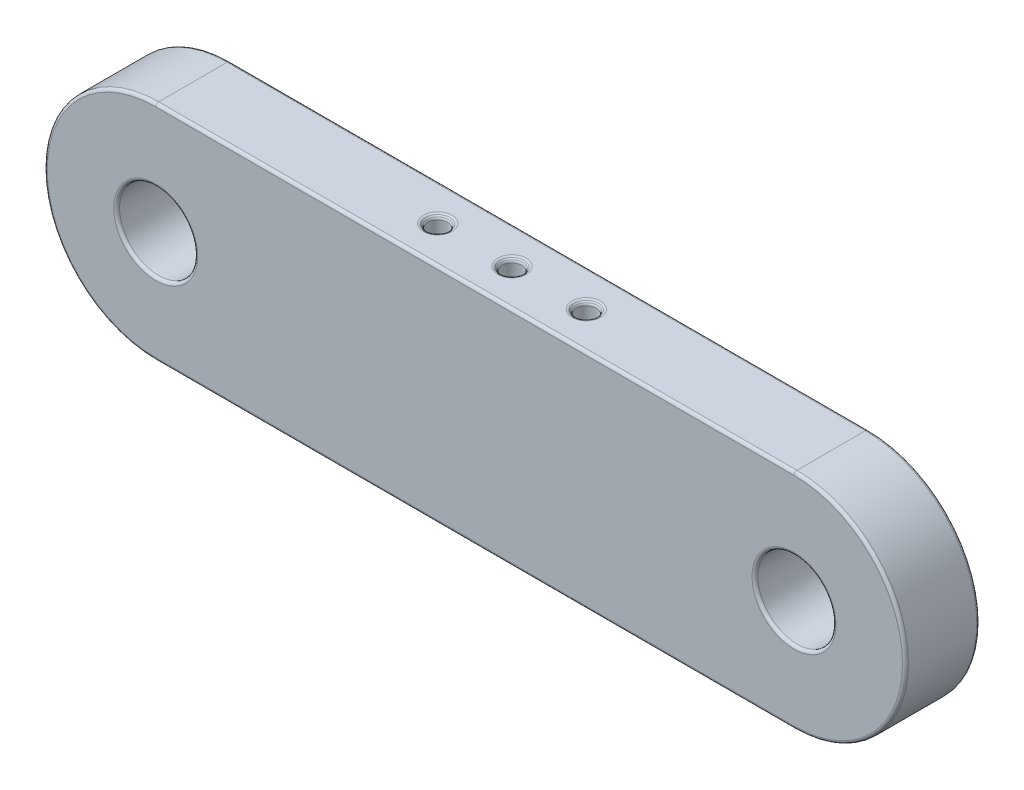
ISO-10303-21;
HEADER;
FILE_DESCRIPTION(('STEP AP214'),'2;1');
FILE_NAME('part.step','',(''),(''),'','','');
FILE_SCHEMA(('AUTOMOTIVE_DESIGN { 1 0 10303 214 1 1 1 1 }'));
ENDSEC;
DATA;
#1=APPLICATION_CONTEXT('core data for automotive mechanical design processes');
#2=APPLICATION_PROTOCOL_DEFINITION('international standard','automotive_design',2000,#1);
#3=PRODUCT_CONTEXT('',#1,'mechanical');
#4=PRODUCT('Part','Part','',(#3));
#5=PRODUCT_RELATED_PRODUCT_CATEGORY('part','',(#4));
#6=PRODUCT_DEFINITION_FORMATION('','',#4);
#7=PRODUCT_DEFINITION_CONTEXT('part definition',#1,'design');
#8=PRODUCT_DEFINITION('design','',#6,#7);
#9=PRODUCT_DEFINITION_SHAPE('','',#8);
#10=(LENGTH_UNIT() NAMED_UNIT(*) SI_UNIT(.MILLI.,.METRE.));
#11=(NAMED_UNIT(*) PLANE_ANGLE_UNIT() SI_UNIT($,.RADIAN.));
#12=(NAMED_UNIT(*) SI_UNIT($,.STERADIAN.) SOLID_ANGLE_UNIT());
#13=UNCERTAINTY_MEASURE_WITH_UNIT(LENGTH_MEASURE(1.E-05),#10,'distance_accuracy_value','');
#14=(GEOMETRIC_REPRESENTATION_CONTEXT(3) GLOBAL_UNCERTAINTY_ASSIGNED_CONTEXT((#13)) GLOBAL_UNIT_ASSIGNED_CONTEXT((#10,
#11,#12)) REPRESENTATION_CONTEXT('',''));
#15=CARTESIAN_POINT('',(0.,0.,0.));
#16=DIRECTION('',(0.,0.,1.));
#17=DIRECTION('',(1.,0.,0.));
#18=AXIS2_PLACEMENT_3D('',#15,#16,#17);
#19=CARTESIAN_POINT('',(-42.95,0.,10.));
#20=DIRECTION('',(0.,0.,1.));
#21=DIRECTION('',(1.,0.,0.));
#22=AXIS2_PLACEMENT_3D('',#19,#20,#21);
#23=PLANE('',#22);
#24=CARTESIAN_POINT('',(42.95,0.,10.));
#25=DIRECTION('',(0.,0.,1.));
#26=DIRECTION('',(1.,0.,0.));
#27=AXIS2_PLACEMENT_3D('',#24,#25,#26);
#28=CIRCLE('',#27,5.65);
#29=CARTESIAN_POINT('',(48.6,0.,10.));
#30=VERTEX_POINT('',#29);
#31=EDGE_CURVE('E254',#30,#30,#28,.F.);
#32=ORIENTED_EDGE('',*,*,#31,.T.);
#33=EDGE_LOOP('',(#32));
#34=FACE_BOUND('',#33,.T.);
#35=CARTESIAN_POINT('',(42.95,0.,10.));
#36=DIRECTION('',(0.,0.,1.));
#37=DIRECTION('',(1.,0.,0.));
#38=AXIS2_PLACEMENT_3D('',#35,#36,#37);
#39=CIRCLE('',#38,14.6);
#40=CARTESIAN_POINT('',(42.95,-14.6,10.));
#41=VERTEX_POINT('',#40);
#42=CARTESIAN_POINT('',(42.95,14.6,10.));
#43=VERTEX_POINT('',#42);
#44=EDGE_CURVE('E52',#41,#43,#39,.T.);
#45=ORIENTED_EDGE('',*,*,#44,.T.);
#46=DIRECTION('',(-1.,0.,0.));
#47=VECTOR('',#46,1.);
#48=CARTESIAN_POINT('',(-42.95,14.6,10.));
#49=LINE('',#48,#47);
#50=CARTESIAN_POINT('',(-42.95,14.6,10.));
#51=VERTEX_POINT('',#50);
#52=EDGE_CURVE('E108',#43,#51,#49,.T.);
#53=ORIENTED_EDGE('',*,*,#52,.T.);
#54=CARTESIAN_POINT('',(-42.95,0.,10.));
#55=DIRECTION('',(0.,0.,1.));
#56=DIRECTION('',(1.,0.,0.));
#57=AXIS2_PLACEMENT_3D('',#54,#55,#56);
#58=CIRCLE('',#57,14.6);
#59=CARTESIAN_POINT('',(-42.95,-14.6,10.));
#60=VERTEX_POINT('',#59);
#61=EDGE_CURVE('E249',#51,#60,#58,.T.);
#62=ORIENTED_EDGE('',*,*,#61,.T.);
#63=DIRECTION('',(1.,0.,0.));
#64=VECTOR('',#63,1.);
#65=CARTESIAN_POINT('',(42.95,-14.6,10.));
#66=LINE('',#65,#64);
#67=EDGE_CURVE('E57',#60,#41,#66,.T.);
#68=ORIENTED_EDGE('',*,*,#67,.T.);
#69=EDGE_LOOP('',(#45,#53,#62,#68));
#70=FACE_BOUND('',#69,.T.);
#71=CARTESIAN_POINT('',(-42.95,0.,10.));
#72=DIRECTION('',(0.,0.,1.));
#73=DIRECTION('',(1.,0.,0.));
#74=AXIS2_PLACEMENT_3D('',#71,#72,#73);
#75=CIRCLE('',#74,5.65);
#76=CARTESIAN_POINT('',(-37.3,0.,10.));
#77=VERTEX_POINT('',#76);
#78=EDGE_CURVE('E246',#77,#77,#75,.F.);
#79=ORIENTED_EDGE('',*,*,#78,.T.);
#80=EDGE_LOOP('',(#79));
#81=FACE_BOUND('',#80,.T.);
#82=ADVANCED_FACE('F35',(#34,#70,#81),#23,.T.);
#83=CARTESIAN_POINT('',(-42.95,0.,0.));
#84=DIRECTION('',(0.,0.,1.));
#85=DIRECTION('',(1.,0.,0.));
#86=AXIS2_PLACEMENT_3D('',#83,#84,#85);
#87=PLANE('',#86);
#88=CARTESIAN_POINT('',(42.95,0.,0.));
#89=DIRECTION('',(0.,0.,1.));
#90=DIRECTION('',(1.,0.,0.));
#91=AXIS2_PLACEMENT_3D('',#88,#89,#90);
#92=CIRCLE('',#91,5.65);
#93=CARTESIAN_POINT('',(48.6,0.,0.));
#94=VERTEX_POINT('',#93);
#95=EDGE_CURVE('E157',#94,#94,#92,.T.);
#96=ORIENTED_EDGE('',*,*,#95,.T.);
#97=EDGE_LOOP('',(#96));
#98=FACE_BOUND('',#97,.T.);
#99=CARTESIAN_POINT('',(-42.95,0.,0.));
#100=DIRECTION('',(0.,0.,1.));
#101=DIRECTION('',(1.,0.,0.));
#102=AXIS2_PLACEMENT_3D('',#99,#100,#101);
#103=CIRCLE('',#102,5.65);
#104=CARTESIAN_POINT('',(-37.3,0.,0.));
#105=VERTEX_POINT('',#104);
#106=EDGE_CURVE('E154',#105,#105,#103,.T.);
#107=ORIENTED_EDGE('',*,*,#106,.T.);
#108=EDGE_LOOP('',(#107));
#109=FACE_BOUND('',#108,.T.);
#110=DIRECTION('',(-1.,0.,0.));
#111=VECTOR('',#110,1.);
#112=CARTESIAN_POINT('',(-42.95,14.6,0.));
#113=LINE('',#112,#111);
#114=CARTESIAN_POINT('',(-42.95,14.6,0.));
#115=VERTEX_POINT('',#114);
#116=CARTESIAN_POINT('',(42.95,14.6,0.));
#117=VERTEX_POINT('',#116);
#118=EDGE_CURVE('E145',#115,#117,#113,.F.);
#119=ORIENTED_EDGE('',*,*,#118,.T.);
#120=CARTESIAN_POINT('',(42.95,0.,0.));
#121=DIRECTION('',(0.,0.,1.));
#122=DIRECTION('',(1.,0.,0.));
#123=AXIS2_PLACEMENT_3D('',#120,#121,#122);
#124=CIRCLE('',#123,14.6);
#125=CARTESIAN_POINT('',(42.95,-14.6,0.));
#126=VERTEX_POINT('',#125);
#127=EDGE_CURVE('E151',#117,#126,#124,.F.);
#128=ORIENTED_EDGE('',*,*,#127,.T.);
#129=DIRECTION('',(1.,0.,0.));
#130=VECTOR('',#129,1.);
#131=CARTESIAN_POINT('',(-42.95,-14.6,0.));
#132=LINE('',#131,#130);
#133=CARTESIAN_POINT('',(-42.95,-14.6,0.));
#134=VERTEX_POINT('',#133);
#135=EDGE_CURVE('E149',#126,#134,#132,.F.);
#136=ORIENTED_EDGE('',*,*,#135,.T.);
#137=CARTESIAN_POINT('',(-42.95,0.,0.));
#138=DIRECTION('',(0.,0.,1.));
#139=DIRECTION('',(1.,0.,0.));
#140=AXIS2_PLACEMENT_3D('',#137,#138,#139);
#141=CIRCLE('',#140,14.6);
#142=EDGE_CURVE('E147',#134,#115,#141,.F.);
#143=ORIENTED_EDGE('',*,*,#142,.T.);
#144=EDGE_LOOP('',(#119,#128,#136,#143));
#145=FACE_BOUND('',#144,.T.);
#146=ADVANCED_FACE('F296',(#98,#109,#145),#87,.F.);
#147=CARTESIAN_POINT('',(-42.95,0.,10.));
#148=DIRECTION('',(0.,0.,-1.));
#149=DIRECTION('',(-1.,0.,0.));
#150=AXIS2_PLACEMENT_3D('',#147,#148,#149);
#151=CYLINDRICAL_SURFACE('',#150,15.);
#152=DIRECTION('',(0.,0.,-1.));
#153=VECTOR('',#152,1.);
#154=CARTESIAN_POINT('',(-42.95,15.,10.));
#155=LINE('',#154,#153);
#156=CARTESIAN_POINT('',(-42.95,15.,9.6));
#157=VERTEX_POINT('',#156);
#158=CARTESIAN_POINT('',(-42.95,15.,0.399999999999999));
#159=VERTEX_POINT('',#158);
#160=EDGE_CURVE('E129',#157,#159,#155,.T.);
#161=ORIENTED_EDGE('',*,*,#160,.T.);
#162=CARTESIAN_POINT('',(-42.95,0.,0.399999999999999));
#163=DIRECTION('',(0.,0.,1.));
#164=DIRECTION('',(1.,0.,0.));
#165=AXIS2_PLACEMENT_3D('',#162,#163,#164);
#166=CIRCLE('',#165,15.);
#167=CARTESIAN_POINT('',(-42.95,-15.,0.399999999999999));
#168=VERTEX_POINT('',#167);
#169=EDGE_CURVE('E175',#159,#168,#166,.T.);
#170=ORIENTED_EDGE('',*,*,#169,.T.);
#171=DIRECTION('',(0.,0.,-1.));
#172=VECTOR('',#171,1.);
#173=CARTESIAN_POINT('',(-42.95,-15.,10.));
#174=LINE('',#173,#172);
#175=CARTESIAN_POINT('',(-42.95,-15.,9.6));
#176=VERTEX_POINT('',#175);
#177=EDGE_CURVE('E121',#176,#168,#174,.T.);
#178=ORIENTED_EDGE('',*,*,#177,.F.);
#179=CARTESIAN_POINT('',(-42.95,0.,9.6));
#180=DIRECTION('',(0.,0.,1.));
#181=DIRECTION('',(1.,0.,0.));
#182=AXIS2_PLACEMENT_3D('',#179,#180,#181);
#183=CIRCLE('',#182,15.);
#184=EDGE_CURVE('E173',#176,#157,#183,.F.);
#185=ORIENTED_EDGE('',*,*,#184,.T.);
#186=EDGE_LOOP('',(#161,#170,#178,#185));
#187=FACE_BOUND('',#186,.T.);
#188=ADVANCED_FACE('F282',(#187),#151,.T.);
#189=CARTESIAN_POINT('',(-42.95,-15.,10.));
#190=DIRECTION('',(0.,1.,0.));
#191=DIRECTION('',(0.,0.,1.));
#192=AXIS2_PLACEMENT_3D('',#189,#190,#191);
#193=PLANE('',#192);
#194=CARTESIAN_POINT('',(-10.0000000000153,-15.,4.99999999999981));
#195=DIRECTION('',(0.,1.,0.));
#196=DIRECTION('',(0.,0.,1.));
#197=AXIS2_PLACEMENT_3D('',#194,#195,#196);
#198=CIRCLE('',#197,1.91568542495053);
#199=CARTESIAN_POINT('',(-10.0000000000153,-15.,6.91568542495034));
#200=VERTEX_POINT('',#199);
#201=EDGE_CURVE('E168',#200,#200,#198,.T.);
#202=ORIENTED_EDGE('',*,*,#201,.T.);
#203=EDGE_LOOP('',(#202));
#204=FACE_BOUND('',#203,.T.);
#205=CARTESIAN_POINT('',(-1.42386102908176E-11,-15.,4.99999999999834));
#206=DIRECTION('',(0.,1.,0.));
#207=DIRECTION('',(0.,0.,1.));
#208=AXIS2_PLACEMENT_3D('',#205,#206,#207);
#209=CIRCLE('',#208,1.91568542494917);
#210=CARTESIAN_POINT('',(-1.42386102908176E-11,-15.,6.91568542494751));
#211=VERTEX_POINT('',#210);
#212=EDGE_CURVE('E165',#211,#211,#209,.T.);
#213=ORIENTED_EDGE('',*,*,#212,.T.);
#214=EDGE_LOOP('',(#213));
#215=FACE_BOUND('',#214,.T.);
#216=CARTESIAN_POINT('',(9.99999999998471,-15.,4.99999999999973));
#217=DIRECTION('',(0.,1.,0.));
#218=DIRECTION('',(0.,0.,1.));
#219=AXIS2_PLACEMENT_3D('',#216,#217,#218);
#220=CIRCLE('',#219,1.9156854249505);
#221=CARTESIAN_POINT('',(9.99999999998471,-15.,6.91568542495023));
#222=VERTEX_POINT('',#221);
#223=EDGE_CURVE('E162',#222,#222,#220,.T.);
#224=ORIENTED_EDGE('',*,*,#223,.T.);
#225=EDGE_LOOP('',(#224));
#226=FACE_BOUND('',#225,.T.);
#227=ORIENTED_EDGE('',*,*,#177,.T.);
#228=DIRECTION('',(1.,0.,0.));
#229=VECTOR('',#228,1.);
#230=CARTESIAN_POINT('',(-42.95,-15.,0.399999999999999));
#231=LINE('',#230,#229);
#232=CARTESIAN_POINT('',(42.95,-15.,0.399999999999999));
#233=VERTEX_POINT('',#232);
#234=EDGE_CURVE('E171',#168,#233,#231,.T.);
#235=ORIENTED_EDGE('',*,*,#234,.T.);
#236=DIRECTION('',(0.,0.,-1.));
#237=VECTOR('',#236,1.);
#238=CARTESIAN_POINT('',(42.95,-15.,10.));
#239=LINE('',#238,#237);
#240=CARTESIAN_POINT('',(42.95,-15.,9.6));
#241=VERTEX_POINT('',#240);
#242=EDGE_CURVE('E136',#241,#233,#239,.T.);
#243=ORIENTED_EDGE('',*,*,#242,.F.);
#244=DIRECTION('',(1.,0.,0.));
#245=VECTOR('',#244,1.);
#246=CARTESIAN_POINT('',(-42.95,-15.,9.6));
#247=LINE('',#246,#245);
#248=EDGE_CURVE('E160',#241,#176,#247,.F.);
#249=ORIENTED_EDGE('',*,*,#248,.T.);
#250=EDGE_LOOP('',(#227,#235,#243,#249));
#251=FACE_BOUND('',#250,.T.);
#252=ADVANCED_FACE('F279',(#204,#215,#226,#251),#193,.F.);
#253=CARTESIAN_POINT('',(42.95,0.,10.));
#254=DIRECTION('',(0.,0.,-1.));
#255=DIRECTION('',(-1.,0.,0.));
#256=AXIS2_PLACEMENT_3D('',#253,#254,#255);
#257=CYLINDRICAL_SURFACE('',#256,15.);
#258=ORIENTED_EDGE('',*,*,#242,.T.);
#259=CARTESIAN_POINT('',(42.95,0.,0.399999999999999));
#260=DIRECTION('',(0.,0.,1.));
#261=DIRECTION('',(1.,0.,0.));
#262=AXIS2_PLACEMENT_3D('',#259,#260,#261);
#263=CIRCLE('',#262,15.);
#264=CARTESIAN_POINT('',(42.95,15.,0.399999999999999));
#265=VERTEX_POINT('',#264);
#266=EDGE_CURVE('E120',#233,#265,#263,.T.);
#267=ORIENTED_EDGE('',*,*,#266,.T.);
#268=DIRECTION('',(0.,0.,-1.));
#269=VECTOR('',#268,1.);
#270=CARTESIAN_POINT('',(42.95,15.,10.));
#271=LINE('',#270,#269);
#272=CARTESIAN_POINT('',(42.95,15.,9.6));
#273=VERTEX_POINT('',#272);
#274=EDGE_CURVE('E127',#273,#265,#271,.T.);
#275=ORIENTED_EDGE('',*,*,#274,.F.);
#276=CARTESIAN_POINT('',(42.95,0.,9.6));
#277=DIRECTION('',(0.,0.,1.));
#278=DIRECTION('',(1.,0.,0.));
#279=AXIS2_PLACEMENT_3D('',#276,#277,#278);
#280=CIRCLE('',#279,15.);
#281=EDGE_CURVE('E114',#273,#241,#280,.F.);
#282=ORIENTED_EDGE('',*,*,#281,.T.);
#283=EDGE_LOOP('',(#258,#267,#275,#282));
#284=FACE_BOUND('',#283,.T.);
#285=ADVANCED_FACE('F134',(#284),#257,.T.);
#286=CARTESIAN_POINT('',(-42.95,15.,10.));
#287=DIRECTION('',(0.,-1.,0.));
#288=DIRECTION('',(0.,0.,-1.));
#289=AXIS2_PLACEMENT_3D('',#286,#287,#288);
#290=PLANE('',#289);
#291=CARTESIAN_POINT('',(9.99999999998471,15.,4.99999999999973));
#292=DIRECTION('',(0.,-1.,0.));
#293=DIRECTION('',(0.,0.,-1.));
#294=AXIS2_PLACEMENT_3D('',#291,#292,#293);
#295=CIRCLE('',#294,1.91568542495049);
#296=CARTESIAN_POINT('',(9.99999999998471,15.,3.08431457504924));
#297=VERTEX_POINT('',#296);
#298=EDGE_CURVE('E195',#297,#297,#295,.T.);
#299=ORIENTED_EDGE('',*,*,#298,.T.);
#300=EDGE_LOOP('',(#299));
#301=FACE_BOUND('',#300,.T.);
#302=CARTESIAN_POINT('',(-1.42386102908176E-11,15.,4.99999999999834));
#303=DIRECTION('',(0.,-1.,0.));
#304=DIRECTION('',(0.,0.,-1.));
#305=AXIS2_PLACEMENT_3D('',#302,#303,#304);
#306=CIRCLE('',#305,1.91568542494916);
#307=CARTESIAN_POINT('',(-1.42386102908176E-11,15.,3.08431457504918));
#308=VERTEX_POINT('',#307);
#309=EDGE_CURVE('E192',#308,#308,#306,.T.);
#310=ORIENTED_EDGE('',*,*,#309,.T.);
#311=EDGE_LOOP('',(#310));
#312=FACE_BOUND('',#311,.T.);
#313=CARTESIAN_POINT('',(-10.0000000000153,15.,4.99999999999981));
#314=DIRECTION('',(0.,-1.,0.));
#315=DIRECTION('',(0.,0.,-1.));
#316=AXIS2_PLACEMENT_3D('',#313,#314,#315);
#317=CIRCLE('',#316,1.91568542495053);
#318=CARTESIAN_POINT('',(-10.0000000000153,15.,3.08431457504928));
#319=VERTEX_POINT('',#318);
#320=EDGE_CURVE('E130',#319,#319,#317,.T.);
#321=ORIENTED_EDGE('',*,*,#320,.T.);
#322=EDGE_LOOP('',(#321));
#323=FACE_BOUND('',#322,.T.);
#324=ORIENTED_EDGE('',*,*,#160,.F.);
#325=DIRECTION('',(-1.,0.,0.));
#326=VECTOR('',#325,1.);
#327=CARTESIAN_POINT('',(42.95,15.,9.6));
#328=LINE('',#327,#326);
#329=EDGE_CURVE('E106',#157,#273,#328,.F.);
#330=ORIENTED_EDGE('',*,*,#329,.T.);
#331=ORIENTED_EDGE('',*,*,#274,.T.);
#332=DIRECTION('',(-1.,0.,0.));
#333=VECTOR('',#332,1.);
#334=CARTESIAN_POINT('',(-42.95,15.,0.399999999999999));
#335=LINE('',#334,#333);
#336=EDGE_CURVE('E131',#265,#159,#335,.T.);
#337=ORIENTED_EDGE('',*,*,#336,.T.);
#338=EDGE_LOOP('',(#324,#330,#331,#337));
#339=FACE_BOUND('',#338,.T.);
#340=ADVANCED_FACE('F126',(#301,#312,#323,#339),#290,.F.);
#341=CARTESIAN_POINT('',(-42.95,0.,10.));
#342=DIRECTION('',(0.,0.,-1.));
#343=DIRECTION('',(-1.,0.,0.));
#344=AXIS2_PLACEMENT_3D('',#341,#342,#343);
#345=CYLINDRICAL_SURFACE('',#344,5.25);
#346=CARTESIAN_POINT('',(-42.95,0.,9.6));
#347=DIRECTION('',(0.,0.,1.));
#348=DIRECTION('',(1.,0.,0.));
#349=AXIS2_PLACEMENT_3D('',#346,#347,#348);
#350=CIRCLE('',#349,5.25);
#351=CARTESIAN_POINT('',(-37.7,0.,9.6));
#352=VERTEX_POINT('',#351);
#353=EDGE_CURVE('E11',#352,#352,#350,.T.);
#354=ORIENTED_EDGE('',*,*,#353,.T.);
#355=EDGE_LOOP('',(#354));
#356=FACE_BOUND('',#355,.T.);
#357=CARTESIAN_POINT('',(-42.95,0.,0.399999999999999));
#358=DIRECTION('',(0.,0.,1.));
#359=DIRECTION('',(1.,0.,0.));
#360=AXIS2_PLACEMENT_3D('',#357,#358,#359);
#361=CIRCLE('',#360,5.25);
#362=CARTESIAN_POINT('',(-37.7,0.,0.399999999999999));
#363=VERTEX_POINT('',#362);
#364=EDGE_CURVE('E44',#363,#363,#361,.F.);
#365=ORIENTED_EDGE('',*,*,#364,.T.);
#366=EDGE_LOOP('',(#365));
#367=FACE_BOUND('',#366,.T.);
#368=ADVANCED_FACE('F321',(#356,#367),#345,.F.);
#369=CARTESIAN_POINT('',(42.95,0.,10.));
#370=DIRECTION('',(0.,0.,-1.));
#371=DIRECTION('',(-1.,0.,0.));
#372=AXIS2_PLACEMENT_3D('',#369,#370,#371);
#373=CYLINDRICAL_SURFACE('',#372,5.25);
#374=CARTESIAN_POINT('',(42.95,0.,9.6));
#375=DIRECTION('',(0.,0.,1.));
#376=DIRECTION('',(1.,0.,0.));
#377=AXIS2_PLACEMENT_3D('',#374,#375,#376);
#378=CIRCLE('',#377,5.25);
#379=CARTESIAN_POINT('',(48.2,0.,9.6));
#380=VERTEX_POINT('',#379);
#381=EDGE_CURVE('E243',#380,#380,#378,.T.);
#382=ORIENTED_EDGE('',*,*,#381,.T.);
#383=EDGE_LOOP('',(#382));
#384=FACE_BOUND('',#383,.T.);
#385=CARTESIAN_POINT('',(42.95,0.,0.399999999999999));
#386=DIRECTION('',(0.,0.,1.));
#387=DIRECTION('',(1.,0.,0.));
#388=AXIS2_PLACEMENT_3D('',#385,#386,#387);
#389=CIRCLE('',#388,5.25);
#390=CARTESIAN_POINT('',(48.2,0.,0.399999999999999));
#391=VERTEX_POINT('',#390);
#392=EDGE_CURVE('E240',#391,#391,#389,.F.);
#393=ORIENTED_EDGE('',*,*,#392,.T.);
#394=EDGE_LOOP('',(#393));
#395=FACE_BOUND('',#394,.T.);
#396=ADVANCED_FACE('F461',(#384,#395),#373,.F.);
#397=CARTESIAN_POINT('',(-10.0000000000153,-15.001,4.99999999999981));
#398=DIRECTION('',(0.,1.,0.));
#399=DIRECTION('',(0.,0.,1.));
#400=AXIS2_PLACEMENT_3D('',#397,#398,#399);
#401=CYLINDRICAL_SURFACE('',#400,1.35000000000129);
#402=CARTESIAN_POINT('',(-10.0000000000153,14.4343145750507,4.99999999999981));
#403=DIRECTION('',(0.,-1.,0.));
#404=DIRECTION('',(0.,0.,-1.));
#405=AXIS2_PLACEMENT_3D('',#402,#403,#404);
#406=CIRCLE('',#405,1.35000000000129);
#407=CARTESIAN_POINT('',(-10.0000000000153,14.4343145750507,3.64999999999852));
#408=VERTEX_POINT('',#407);
#409=EDGE_CURVE('E213',#408,#408,#406,.F.);
#410=ORIENTED_EDGE('',*,*,#409,.T.);
#411=EDGE_LOOP('',(#410));
#412=FACE_BOUND('',#411,.T.);
#413=CARTESIAN_POINT('',(-10.0000000000153,-14.4343145750508,4.99999999999981));
#414=DIRECTION('',(0.,1.,0.));
#415=DIRECTION('',(0.,0.,1.));
#416=AXIS2_PLACEMENT_3D('',#413,#414,#415);
#417=CIRCLE('',#416,1.35000000000129);
#418=CARTESIAN_POINT('',(-10.0000000000153,-14.4343145750508,6.3500000000011));
#419=VERTEX_POINT('',#418);
#420=EDGE_CURVE('E210',#419,#419,#417,.F.);
#421=ORIENTED_EDGE('',*,*,#420,.T.);
#422=EDGE_LOOP('',(#421));
#423=FACE_BOUND('',#422,.T.);
#424=ADVANCED_FACE('F463',(#412,#423),#401,.F.);
#425=CARTESIAN_POINT('',(-1.42386102908176E-11,-15.001,4.99999999999834));
#426=DIRECTION('',(0.,1.,0.));
#427=DIRECTION('',(0.,0.,1.));
#428=AXIS2_PLACEMENT_3D('',#425,#426,#427);
#429=CYLINDRICAL_SURFACE('',#428,1.34999999999992);
#430=CARTESIAN_POINT('',(-1.42386102908176E-11,14.4343145750508,4.99999999999834));
#431=DIRECTION('',(0.,-1.,0.));
#432=DIRECTION('',(0.,0.,-1.));
#433=AXIS2_PLACEMENT_3D('',#430,#431,#432);
#434=CIRCLE('',#433,1.34999999999992);
#435=CARTESIAN_POINT('',(-1.42386102908176E-11,14.4343145750508,3.64999999999841));
#436=VERTEX_POINT('',#435);
#437=EDGE_CURVE('E201',#436,#436,#434,.F.);
#438=ORIENTED_EDGE('',*,*,#437,.T.);
#439=EDGE_LOOP('',(#438));
#440=FACE_BOUND('',#439,.T.);
#441=CARTESIAN_POINT('',(-1.42386102908176E-11,-14.4343145750508,4.99999999999834));
#442=DIRECTION('',(0.,1.,0.));
#443=DIRECTION('',(0.,0.,1.));
#444=AXIS2_PLACEMENT_3D('',#441,#442,#443);
#445=CIRCLE('',#444,1.34999999999992);
#446=CARTESIAN_POINT('',(-1.42386102908176E-11,-14.4343145750508,6.34999999999826));
#447=VERTEX_POINT('',#446);
#448=EDGE_CURVE('E198',#447,#447,#445,.F.);
#449=ORIENTED_EDGE('',*,*,#448,.T.);
#450=EDGE_LOOP('',(#449));
#451=FACE_BOUND('',#450,.T.);
#452=ADVANCED_FACE('F469',(#440,#451),#429,.F.);
#453=CARTESIAN_POINT('',(9.99999999998471,-15.001,4.99999999999973));
#454=DIRECTION('',(0.,1.,0.));
#455=DIRECTION('',(0.,0.,1.));
#456=AXIS2_PLACEMENT_3D('',#453,#454,#455);
#457=CYLINDRICAL_SURFACE('',#456,1.35000000000126);
#458=CARTESIAN_POINT('',(9.99999999998471,14.4343145750508,4.99999999999973));
#459=DIRECTION('',(0.,-1.,0.));
#460=DIRECTION('',(0.,0.,-1.));
#461=AXIS2_PLACEMENT_3D('',#458,#459,#460);
#462=CIRCLE('',#461,1.35000000000126);
#463=CARTESIAN_POINT('',(9.99999999998471,14.4343145750508,3.64999999999847));
#464=VERTEX_POINT('',#463);
#465=EDGE_CURVE('E180',#464,#464,#462,.F.);
#466=ORIENTED_EDGE('',*,*,#465,.T.);
#467=EDGE_LOOP('',(#466));
#468=FACE_BOUND('',#467,.T.);
#469=CARTESIAN_POINT('',(9.99999999998471,-14.4343145750508,4.99999999999973));
#470=DIRECTION('',(0.,1.,0.));
#471=DIRECTION('',(0.,0.,1.));
#472=AXIS2_PLACEMENT_3D('',#469,#470,#471);
#473=CIRCLE('',#472,1.35000000000126);
#474=CARTESIAN_POINT('',(9.99999999998471,-14.4343145750508,6.35000000000099));
#475=VERTEX_POINT('',#474);
#476=EDGE_CURVE('E177',#475,#475,#473,.F.);
#477=ORIENTED_EDGE('',*,*,#476,.T.);
#478=EDGE_LOOP('',(#477));
#479=FACE_BOUND('',#478,.T.);
#480=ADVANCED_FACE('F342',(#468,#479),#457,.F.);
#481=CARTESIAN_POINT('',(-10.0000000000153,-14.6,4.99999999999981));
#482=DIRECTION('',(0.,-1.,0.));
#483=DIRECTION('',(0.,0.,-1.));
#484=AXIS2_PLACEMENT_3D('',#481,#482,#483);
#485=CONICAL_SURFACE('',#484,1.35000000000129,0.785398163397456);
#486=CARTESIAN_POINT('',(-10.0000000000153,-14.7171572875254,4.99999999999981));
#487=DIRECTION('',(0.,-1.,0.));
#488=DIRECTION('',(0.,0.,-1.));
#489=AXIS2_PLACEMENT_3D('',#486,#487,#488);
#490=CIRCLE('',#489,1.46715728752667);
#491=CARTESIAN_POINT('',(-10.0000000000153,-14.7171572875254,3.53284271247314));
#492=VERTEX_POINT('',#491);
#493=EDGE_CURVE('E225',#492,#492,#490,.F.);
#494=ORIENTED_EDGE('',*,*,#493,.T.);
#495=EDGE_LOOP('',(#494));
#496=FACE_BOUND('',#495,.T.);
#497=CARTESIAN_POINT('',(-10.0000000000153,-14.8828427124746,4.99999999999981));
#498=DIRECTION('',(0.,-1.,0.));
#499=DIRECTION('',(0.,0.,-1.));
#500=AXIS2_PLACEMENT_3D('',#497,#498,#499);
#501=CIRCLE('',#500,1.63284271247591);
#502=CARTESIAN_POINT('',(-10.0000000000153,-14.8828427124746,3.3671572875239));
#503=VERTEX_POINT('',#502);
#504=EDGE_CURVE('E222',#503,#503,#501,.T.);
#505=ORIENTED_EDGE('',*,*,#504,.T.);
#506=EDGE_LOOP('',(#505));
#507=FACE_BOUND('',#506,.T.);
#508=ADVANCED_FACE('F335',(#496,#507),#485,.F.);
#509=CARTESIAN_POINT('',(-1.42386102908176E-11,-14.6,4.99999999999834));
#510=DIRECTION('',(0.,-1.,0.));
#511=DIRECTION('',(0.,0.,-1.));
#512=AXIS2_PLACEMENT_3D('',#509,#510,#511);
#513=CONICAL_SURFACE('',#512,1.34999999999992,0.785398163397456);
#514=CARTESIAN_POINT('',(-1.42386102908176E-11,-14.7171572875254,4.99999999999834));
#515=DIRECTION('',(0.,-1.,0.));
#516=DIRECTION('',(0.,0.,-1.));
#517=AXIS2_PLACEMENT_3D('',#514,#515,#516);
#518=CIRCLE('',#517,1.46715728752531);
#519=CARTESIAN_POINT('',(-1.42386102908176E-11,-14.7171572875254,3.53284271247303));
#520=VERTEX_POINT('',#519);
#521=EDGE_CURVE('E231',#520,#520,#518,.F.);
#522=ORIENTED_EDGE('',*,*,#521,.T.);
#523=EDGE_LOOP('',(#522));
#524=FACE_BOUND('',#523,.T.);
#525=CARTESIAN_POINT('',(-1.42386102908176E-11,-14.8828427124746,4.99999999999834));
#526=DIRECTION('',(0.,-1.,0.));
#527=DIRECTION('',(0.,0.,-1.));
#528=AXIS2_PLACEMENT_3D('',#525,#526,#527);
#529=CIRCLE('',#528,1.63284271247455);
#530=CARTESIAN_POINT('',(-1.42386102908176E-11,-14.8828427124746,3.36715728752379));
#531=VERTEX_POINT('',#530);
#532=EDGE_CURVE('E228',#531,#531,#529,.T.);
#533=ORIENTED_EDGE('',*,*,#532,.T.);
#534=EDGE_LOOP('',(#533));
#535=FACE_BOUND('',#534,.T.);
#536=ADVANCED_FACE('F341',(#524,#535),#513,.F.);
#537=CARTESIAN_POINT('',(9.99999999998471,-14.6,4.99999999999973));
#538=DIRECTION('',(0.,-1.,0.));
#539=DIRECTION('',(0.,0.,-1.));
#540=AXIS2_PLACEMENT_3D('',#537,#538,#539);
#541=CONICAL_SURFACE('',#540,1.35000000000126,0.785398163397458);
#542=CARTESIAN_POINT('',(9.99999999998471,-14.7171572875254,4.99999999999973));
#543=DIRECTION('',(0.,-1.,0.));
#544=DIRECTION('',(0.,0.,-1.));
#545=AXIS2_PLACEMENT_3D('',#542,#543,#544);
#546=CIRCLE('',#545,1.46715728752664);
#547=CARTESIAN_POINT('',(9.99999999998471,-14.7171572875254,3.53284271247308));
#548=VERTEX_POINT('',#547);
#549=EDGE_CURVE('E237',#548,#548,#546,.F.);
#550=ORIENTED_EDGE('',*,*,#549,.T.);
#551=EDGE_LOOP('',(#550));
#552=FACE_BOUND('',#551,.T.);
#553=CARTESIAN_POINT('',(9.99999999998471,-14.8828427124746,4.99999999999973));
#554=DIRECTION('',(0.,-1.,0.));
#555=DIRECTION('',(0.,0.,-1.));
#556=AXIS2_PLACEMENT_3D('',#553,#554,#555);
#557=CIRCLE('',#556,1.63284271247588);
#558=CARTESIAN_POINT('',(9.99999999998471,-14.8828427124746,3.36715728752384));
#559=VERTEX_POINT('',#558);
#560=EDGE_CURVE('E234',#559,#559,#557,.T.);
#561=ORIENTED_EDGE('',*,*,#560,.T.);
#562=EDGE_LOOP('',(#561));
#563=FACE_BOUND('',#562,.T.);
#564=ADVANCED_FACE('F349',(#552,#563),#541,.F.);
#565=CARTESIAN_POINT('',(9.99999999998471,14.6,4.99999999999973));
#566=DIRECTION('',(0.,1.,0.));
#567=DIRECTION('',(0.,0.,1.));
#568=AXIS2_PLACEMENT_3D('',#565,#566,#567);
#569=CONICAL_SURFACE('',#568,1.35000000000126,0.78539816339744);
#570=CARTESIAN_POINT('',(9.99999999998471,14.7171572875254,4.99999999999973));
#571=DIRECTION('',(0.,1.,0.));
#572=DIRECTION('',(0.,0.,1.));
#573=AXIS2_PLACEMENT_3D('',#570,#571,#572);
#574=CIRCLE('',#573,1.46715728752664);
#575=CARTESIAN_POINT('',(9.99999999998471,14.7171572875254,6.46715728752637));
#576=VERTEX_POINT('',#575);
#577=EDGE_CURVE('E186',#576,#576,#574,.F.);
#578=ORIENTED_EDGE('',*,*,#577,.T.);
#579=EDGE_LOOP('',(#578));
#580=FACE_BOUND('',#579,.T.);
#581=CARTESIAN_POINT('',(9.99999999998471,14.8828427124746,4.99999999999973));
#582=DIRECTION('',(0.,1.,0.));
#583=DIRECTION('',(0.,0.,1.));
#584=AXIS2_PLACEMENT_3D('',#581,#582,#583);
#585=CIRCLE('',#584,1.63284271247587);
#586=CARTESIAN_POINT('',(9.99999999998471,14.8828427124746,6.6328427124756));
#587=VERTEX_POINT('',#586);
#588=EDGE_CURVE('E183',#587,#587,#585,.T.);
#589=ORIENTED_EDGE('',*,*,#588,.T.);
#590=EDGE_LOOP('',(#589));
#591=FACE_BOUND('',#590,.T.);
#592=ADVANCED_FACE('F356',(#580,#591),#569,.F.);
#593=CARTESIAN_POINT('',(-1.42386102908176E-11,14.6,4.99999999999834));
#594=DIRECTION('',(0.,1.,0.));
#595=DIRECTION('',(0.,0.,1.));
#596=AXIS2_PLACEMENT_3D('',#593,#594,#595);
#597=CONICAL_SURFACE('',#596,1.34999999999992,0.785398163397439);
#598=CARTESIAN_POINT('',(-1.42386102908176E-11,14.7171572875254,4.99999999999834));
#599=DIRECTION('',(0.,1.,0.));
#600=DIRECTION('',(0.,0.,1.));
#601=AXIS2_PLACEMENT_3D('',#598,#599,#600);
#602=CIRCLE('',#601,1.4671572875253);
#603=CARTESIAN_POINT('',(-1.42386102908176E-11,14.7171572875254,6.46715728752364));
#604=VERTEX_POINT('',#603);
#605=EDGE_CURVE('E207',#604,#604,#602,.F.);
#606=ORIENTED_EDGE('',*,*,#605,.T.);
#607=EDGE_LOOP('',(#606));
#608=FACE_BOUND('',#607,.T.);
#609=CARTESIAN_POINT('',(-1.42386102908176E-11,14.8828427124746,4.99999999999834));
#610=DIRECTION('',(0.,1.,0.));
#611=DIRECTION('',(0.,0.,1.));
#612=AXIS2_PLACEMENT_3D('',#609,#610,#611);
#613=CIRCLE('',#612,1.63284271247454);
#614=CARTESIAN_POINT('',(-1.42386102908176E-11,14.8828427124746,6.63284271247288));
#615=VERTEX_POINT('',#614);
#616=EDGE_CURVE('E204',#615,#615,#613,.T.);
#617=ORIENTED_EDGE('',*,*,#616,.T.);
#618=EDGE_LOOP('',(#617));
#619=FACE_BOUND('',#618,.T.);
#620=ADVANCED_FACE('F363',(#608,#619),#597,.F.);
#621=CARTESIAN_POINT('',(-10.0000000000153,14.6,4.99999999999981));
#622=DIRECTION('',(0.,1.,0.));
#623=DIRECTION('',(0.,0.,1.));
#624=AXIS2_PLACEMENT_3D('',#621,#622,#623);
#625=CONICAL_SURFACE('',#624,1.35000000000129,0.785398163397441);
#626=CARTESIAN_POINT('',(-10.0000000000153,14.7171572875254,4.99999999999981));
#627=DIRECTION('',(0.,1.,0.));
#628=DIRECTION('',(0.,0.,1.));
#629=AXIS2_PLACEMENT_3D('',#626,#627,#628);
#630=CIRCLE('',#629,1.46715728752667);
#631=CARTESIAN_POINT('',(-10.0000000000153,14.7171572875254,6.46715728752648));
#632=VERTEX_POINT('',#631);
#633=EDGE_CURVE('E219',#632,#632,#630,.F.);
#634=ORIENTED_EDGE('',*,*,#633,.T.);
#635=EDGE_LOOP('',(#634));
#636=FACE_BOUND('',#635,.T.);
#637=CARTESIAN_POINT('',(-10.0000000000153,14.8828427124746,4.99999999999981));
#638=DIRECTION('',(0.,1.,0.));
#639=DIRECTION('',(0.,0.,1.));
#640=AXIS2_PLACEMENT_3D('',#637,#638,#639);
#641=CIRCLE('',#640,1.63284271247591);
#642=CARTESIAN_POINT('',(-10.0000000000153,14.8828427124746,6.63284271247572));
#643=VERTEX_POINT('',#642);
#644=EDGE_CURVE('E216',#643,#643,#641,.T.);
#645=ORIENTED_EDGE('',*,*,#644,.T.);
#646=EDGE_LOOP('',(#645));
#647=FACE_BOUND('',#646,.T.);
#648=ADVANCED_FACE('F310',(#636,#647),#625,.F.);
#649=CARTESIAN_POINT('',(-42.95,0.,0.399999999999999));
#650=DIRECTION('',(0.,0.,1.));
#651=DIRECTION('',(1.,0.,0.));
#652=AXIS2_PLACEMENT_3D('',#649,#650,#651);
#653=TOROIDAL_SURFACE('',#652,14.6,0.4);
#654=CARTESIAN_POINT('',(-42.95,14.6,0.4));
#655=DIRECTION('',(1.,0.,0.));
#656=DIRECTION('',(0.,0.,-1.));
#657=AXIS2_PLACEMENT_3D('',#654,#655,#656);
#658=CIRCLE('',#657,0.4);
#659=EDGE_CURVE('E263',#115,#159,#658,.T.);
#660=ORIENTED_EDGE('',*,*,#659,.F.);
#661=ORIENTED_EDGE('',*,*,#142,.F.);
#662=CARTESIAN_POINT('',(-42.95,-14.6,0.399999999999999));
#663=DIRECTION('',(1.,0.,0.));
#664=DIRECTION('',(0.,0.,-1.));
#665=AXIS2_PLACEMENT_3D('',#662,#663,#664);
#666=CIRCLE('',#665,0.4);
#667=EDGE_CURVE('E139',#168,#134,#666,.T.);
#668=ORIENTED_EDGE('',*,*,#667,.F.);
#669=ORIENTED_EDGE('',*,*,#169,.F.);
#670=EDGE_LOOP('',(#660,#661,#668,#669));
#671=FACE_BOUND('',#670,.T.);
#672=ADVANCED_FACE('F286',(#671),#653,.T.);
#673=CARTESIAN_POINT('',(-42.95,-14.6,0.399999999999999));
#674=DIRECTION('',(1.,0.,0.));
#675=DIRECTION('',(0.,0.,-1.));
#676=AXIS2_PLACEMENT_3D('',#673,#674,#675);
#677=CYLINDRICAL_SURFACE('',#676,0.4);
#678=ORIENTED_EDGE('',*,*,#667,.T.);
#679=ORIENTED_EDGE('',*,*,#135,.F.);
#680=CARTESIAN_POINT('',(42.95,-14.6,0.399999999999999));
#681=DIRECTION('',(1.,0.,0.));
#682=DIRECTION('',(0.,0.,-1.));
#683=AXIS2_PLACEMENT_3D('',#680,#681,#682);
#684=CIRCLE('',#683,0.4);
#685=EDGE_CURVE('E261',#233,#126,#684,.T.);
#686=ORIENTED_EDGE('',*,*,#685,.F.);
#687=ORIENTED_EDGE('',*,*,#234,.F.);
#688=EDGE_LOOP('',(#678,#679,#686,#687));
#689=FACE_BOUND('',#688,.T.);
#690=ADVANCED_FACE('F302',(#689),#677,.T.);
#691=CARTESIAN_POINT('',(-42.95,14.6,0.399999999999999));
#692=DIRECTION('',(-1.,0.,0.));
#693=DIRECTION('',(0.,0.,1.));
#694=AXIS2_PLACEMENT_3D('',#691,#692,#693);
#695=CYLINDRICAL_SURFACE('',#694,0.4);
#696=ORIENTED_EDGE('',*,*,#659,.T.);
#697=ORIENTED_EDGE('',*,*,#336,.F.);
#698=CARTESIAN_POINT('',(42.95,14.6,0.4));
#699=DIRECTION('',(1.,0.,0.));
#700=DIRECTION('',(0.,0.,-1.));
#701=AXIS2_PLACEMENT_3D('',#698,#699,#700);
#702=CIRCLE('',#701,0.4);
#703=EDGE_CURVE('E259',#117,#265,#702,.T.);
#704=ORIENTED_EDGE('',*,*,#703,.F.);
#705=ORIENTED_EDGE('',*,*,#118,.F.);
#706=EDGE_LOOP('',(#696,#697,#704,#705));
#707=FACE_BOUND('',#706,.T.);
#708=ADVANCED_FACE('F292',(#707),#695,.T.);
#709=CARTESIAN_POINT('',(42.95,0.,0.399999999999999));
#710=DIRECTION('',(0.,0.,1.));
#711=DIRECTION('',(1.,0.,0.));
#712=AXIS2_PLACEMENT_3D('',#709,#710,#711);
#713=TOROIDAL_SURFACE('',#712,14.6,0.4);
#714=ORIENTED_EDGE('',*,*,#685,.T.);
#715=ORIENTED_EDGE('',*,*,#127,.F.);
#716=ORIENTED_EDGE('',*,*,#703,.T.);
#717=ORIENTED_EDGE('',*,*,#266,.F.);
#718=EDGE_LOOP('',(#714,#715,#716,#717));
#719=FACE_BOUND('',#718,.T.);
#720=ADVANCED_FACE('F298',(#719),#713,.T.);
#721=CARTESIAN_POINT('',(9.99999999998471,14.4343145750508,4.99999999999973));
#722=DIRECTION('',(0.,-1.,0.));
#723=DIRECTION('',(0.,0.,-1.));
#724=AXIS2_PLACEMENT_3D('',#721,#722,#723);
#725=TOROIDAL_SURFACE('',#724,1.75000000000126,0.4);
#726=ORIENTED_EDGE('',*,*,#577,.F.);
#727=EDGE_LOOP('',(#726));
#728=FACE_BOUND('',#727,.T.);
#729=ORIENTED_EDGE('',*,*,#465,.F.);
#730=EDGE_LOOP('',(#729));
#731=FACE_BOUND('',#730,.T.);
#732=ADVANCED_FACE('F377',(#728,#731),#725,.T.);
#733=CARTESIAN_POINT('',(9.99999999998471,14.6,4.99999999999973));
#734=DIRECTION('',(0.,-1.,0.));
#735=DIRECTION('',(0.,0.,-1.));
#736=AXIS2_PLACEMENT_3D('',#733,#734,#735);
#737=TOROIDAL_SURFACE('',#736,1.91568542495049,0.4);
#738=ORIENTED_EDGE('',*,*,#588,.F.);
#739=EDGE_LOOP('',(#738));
#740=FACE_BOUND('',#739,.T.);
#741=ORIENTED_EDGE('',*,*,#298,.F.);
#742=EDGE_LOOP('',(#741));
#743=FACE_BOUND('',#742,.T.);
#744=ADVANCED_FACE('F381',(#740,#743),#737,.T.);
#745=CARTESIAN_POINT('',(-1.42386102908176E-11,14.4343145750508,4.99999999999834));
#746=DIRECTION('',(0.,-1.,0.));
#747=DIRECTION('',(0.,0.,-1.));
#748=AXIS2_PLACEMENT_3D('',#745,#746,#747);
#749=TOROIDAL_SURFACE('',#748,1.74999999999993,0.4);
#750=ORIENTED_EDGE('',*,*,#605,.F.);
#751=EDGE_LOOP('',(#750));
#752=FACE_BOUND('',#751,.T.);
#753=ORIENTED_EDGE('',*,*,#437,.F.);
#754=EDGE_LOOP('',(#753));
#755=FACE_BOUND('',#754,.T.);
#756=ADVANCED_FACE('F387',(#752,#755),#749,.T.);
#757=CARTESIAN_POINT('',(-1.42386102908176E-11,14.6,4.99999999999834));
#758=DIRECTION('',(0.,-1.,0.));
#759=DIRECTION('',(0.,0.,-1.));
#760=AXIS2_PLACEMENT_3D('',#757,#758,#759);
#761=TOROIDAL_SURFACE('',#760,1.91568542494916,0.4);
#762=ORIENTED_EDGE('',*,*,#616,.F.);
#763=EDGE_LOOP('',(#762));
#764=FACE_BOUND('',#763,.T.);
#765=ORIENTED_EDGE('',*,*,#309,.F.);
#766=EDGE_LOOP('',(#765));
#767=FACE_BOUND('',#766,.T.);
#768=ADVANCED_FACE('F395',(#764,#767),#761,.T.);
#769=CARTESIAN_POINT('',(-10.0000000000153,14.4343145750507,4.99999999999981));
#770=DIRECTION('',(0.,-1.,0.));
#771=DIRECTION('',(0.,0.,-1.));
#772=AXIS2_PLACEMENT_3D('',#769,#770,#771);
#773=TOROIDAL_SURFACE('',#772,1.75000000000129,0.4);
#774=ORIENTED_EDGE('',*,*,#633,.F.);
#775=EDGE_LOOP('',(#774));
#776=FACE_BOUND('',#775,.T.);
#777=ORIENTED_EDGE('',*,*,#409,.F.);
#778=EDGE_LOOP('',(#777));
#779=FACE_BOUND('',#778,.T.);
#780=ADVANCED_FACE('F399',(#776,#779),#773,.T.);
#781=CARTESIAN_POINT('',(-10.0000000000153,14.6,4.99999999999981));
#782=DIRECTION('',(0.,-1.,0.));
#783=DIRECTION('',(0.,0.,-1.));
#784=AXIS2_PLACEMENT_3D('',#781,#782,#783);
#785=TOROIDAL_SURFACE('',#784,1.91568542495053,0.4);
#786=ORIENTED_EDGE('',*,*,#644,.F.);
#787=EDGE_LOOP('',(#786));
#788=FACE_BOUND('',#787,.T.);
#789=ORIENTED_EDGE('',*,*,#320,.F.);
#790=EDGE_LOOP('',(#789));
#791=FACE_BOUND('',#790,.T.);
#792=ADVANCED_FACE('F403',(#788,#791),#785,.T.);
#793=CARTESIAN_POINT('',(-10.0000000000153,-14.4343145750508,4.99999999999981));
#794=DIRECTION('',(0.,1.,0.));
#795=DIRECTION('',(0.,0.,1.));
#796=AXIS2_PLACEMENT_3D('',#793,#794,#795);
#797=TOROIDAL_SURFACE('',#796,1.75000000000129,0.4);
#798=ORIENTED_EDGE('',*,*,#493,.F.);
#799=EDGE_LOOP('',(#798));
#800=FACE_BOUND('',#799,.T.);
#801=ORIENTED_EDGE('',*,*,#420,.F.);
#802=EDGE_LOOP('',(#801));
#803=FACE_BOUND('',#802,.T.);
#804=ADVANCED_FACE('F407',(#800,#803),#797,.T.);
#805=CARTESIAN_POINT('',(-10.0000000000153,-14.6,4.99999999999981));
#806=DIRECTION('',(0.,1.,0.));
#807=DIRECTION('',(0.,0.,1.));
#808=AXIS2_PLACEMENT_3D('',#805,#806,#807);
#809=TOROIDAL_SURFACE('',#808,1.91568542495053,0.4);
#810=ORIENTED_EDGE('',*,*,#504,.F.);
#811=EDGE_LOOP('',(#810));
#812=FACE_BOUND('',#811,.T.);
#813=ORIENTED_EDGE('',*,*,#201,.F.);
#814=EDGE_LOOP('',(#813));
#815=FACE_BOUND('',#814,.T.);
#816=ADVANCED_FACE('F411',(#812,#815),#809,.T.);
#817=CARTESIAN_POINT('',(-1.42386102908176E-11,-14.4343145750508,4.99999999999834));
#818=DIRECTION('',(0.,1.,0.));
#819=DIRECTION('',(0.,0.,1.));
#820=AXIS2_PLACEMENT_3D('',#817,#818,#819);
#821=TOROIDAL_SURFACE('',#820,1.74999999999993,0.4);
#822=ORIENTED_EDGE('',*,*,#521,.F.);
#823=EDGE_LOOP('',(#822));
#824=FACE_BOUND('',#823,.T.);
#825=ORIENTED_EDGE('',*,*,#448,.F.);
#826=EDGE_LOOP('',(#825));
#827=FACE_BOUND('',#826,.T.);
#828=ADVANCED_FACE('F415',(#824,#827),#821,.T.);
#829=CARTESIAN_POINT('',(-1.42386102908176E-11,-14.6,4.99999999999834));
#830=DIRECTION('',(0.,1.,0.));
#831=DIRECTION('',(0.,0.,1.));
#832=AXIS2_PLACEMENT_3D('',#829,#830,#831);
#833=TOROIDAL_SURFACE('',#832,1.91568542494917,0.4);
#834=ORIENTED_EDGE('',*,*,#532,.F.);
#835=EDGE_LOOP('',(#834));
#836=FACE_BOUND('',#835,.T.);
#837=ORIENTED_EDGE('',*,*,#212,.F.);
#838=EDGE_LOOP('',(#837));
#839=FACE_BOUND('',#838,.T.);
#840=ADVANCED_FACE('F419',(#836,#839),#833,.T.);
#841=CARTESIAN_POINT('',(9.99999999998471,-14.4343145750508,4.99999999999973));
#842=DIRECTION('',(0.,1.,0.));
#843=DIRECTION('',(0.,0.,1.));
#844=AXIS2_PLACEMENT_3D('',#841,#842,#843);
#845=TOROIDAL_SURFACE('',#844,1.75000000000126,0.4);
#846=ORIENTED_EDGE('',*,*,#549,.F.);
#847=EDGE_LOOP('',(#846));
#848=FACE_BOUND('',#847,.T.);
#849=ORIENTED_EDGE('',*,*,#476,.F.);
#850=EDGE_LOOP('',(#849));
#851=FACE_BOUND('',#850,.T.);
#852=ADVANCED_FACE('F423',(#848,#851),#845,.T.);
#853=CARTESIAN_POINT('',(9.99999999998471,-14.6,4.99999999999973));
#854=DIRECTION('',(0.,1.,0.));
#855=DIRECTION('',(0.,0.,1.));
#856=AXIS2_PLACEMENT_3D('',#853,#854,#855);
#857=TOROIDAL_SURFACE('',#856,1.9156854249505,0.4);
#858=ORIENTED_EDGE('',*,*,#560,.F.);
#859=EDGE_LOOP('',(#858));
#860=FACE_BOUND('',#859,.T.);
#861=ORIENTED_EDGE('',*,*,#223,.F.);
#862=EDGE_LOOP('',(#861));
#863=FACE_BOUND('',#862,.T.);
#864=ADVANCED_FACE('F427',(#860,#863),#857,.T.);
#865=CARTESIAN_POINT('',(42.95,0.,9.6));
#866=DIRECTION('',(0.,0.,1.));
#867=DIRECTION('',(1.,0.,0.));
#868=AXIS2_PLACEMENT_3D('',#865,#866,#867);
#869=TOROIDAL_SURFACE('',#868,5.65,0.4);
#870=ORIENTED_EDGE('',*,*,#31,.F.);
#871=EDGE_LOOP('',(#870));
#872=FACE_BOUND('',#871,.T.);
#873=ORIENTED_EDGE('',*,*,#381,.F.);
#874=EDGE_LOOP('',(#873));
#875=FACE_BOUND('',#874,.T.);
#876=ADVANCED_FACE('F431',(#872,#875),#869,.T.);
#877=CARTESIAN_POINT('',(-42.95,-14.6,9.6));
#878=DIRECTION('',(-1.,0.,0.));
#879=DIRECTION('',(0.,0.,1.));
#880=AXIS2_PLACEMENT_3D('',#877,#878,#879);
#881=CYLINDRICAL_SURFACE('',#880,0.4);
#882=CARTESIAN_POINT('',(-42.95,-14.6,9.6));
#883=DIRECTION('',(-1.,0.,0.));
#884=DIRECTION('',(0.,0.,1.));
#885=AXIS2_PLACEMENT_3D('',#882,#883,#884);
#886=CIRCLE('',#885,0.4);
#887=EDGE_CURVE('E110',#176,#60,#886,.T.);
#888=ORIENTED_EDGE('',*,*,#887,.F.);
#889=ORIENTED_EDGE('',*,*,#248,.F.);
#890=CARTESIAN_POINT('',(42.95,-14.6,9.6));
#891=DIRECTION('',(1.,0.,0.));
#892=DIRECTION('',(0.,0.,-1.));
#893=AXIS2_PLACEMENT_3D('',#890,#891,#892);
#894=CIRCLE('',#893,0.4);
#895=EDGE_CURVE('E39',#41,#241,#894,.T.);
#896=ORIENTED_EDGE('',*,*,#895,.F.);
#897=ORIENTED_EDGE('',*,*,#67,.F.);
#898=EDGE_LOOP('',(#888,#889,#896,#897));
#899=FACE_BOUND('',#898,.T.);
#900=ADVANCED_FACE('F276',(#899),#881,.T.);
#901=CARTESIAN_POINT('',(42.95,0.,9.6));
#902=DIRECTION('',(0.,0.,1.));
#903=DIRECTION('',(1.,0.,0.));
#904=AXIS2_PLACEMENT_3D('',#901,#902,#903);
#905=TOROIDAL_SURFACE('',#904,14.6,0.4);
#906=ORIENTED_EDGE('',*,*,#895,.T.);
#907=ORIENTED_EDGE('',*,*,#281,.F.);
#908=CARTESIAN_POINT('',(42.95,14.6,9.6));
#909=DIRECTION('',(-1.,0.,0.));
#910=DIRECTION('',(0.,0.,1.));
#911=AXIS2_PLACEMENT_3D('',#908,#909,#910);
#912=CIRCLE('',#911,0.4);
#913=EDGE_CURVE('E102',#43,#273,#912,.T.);
#914=ORIENTED_EDGE('',*,*,#913,.F.);
#915=ORIENTED_EDGE('',*,*,#44,.F.);
#916=EDGE_LOOP('',(#906,#907,#914,#915));
#917=FACE_BOUND('',#916,.T.);
#918=ADVANCED_FACE('F115',(#917),#905,.T.);
#919=CARTESIAN_POINT('',(-42.95,0.,9.6));
#920=DIRECTION('',(0.,0.,1.));
#921=DIRECTION('',(1.,0.,0.));
#922=AXIS2_PLACEMENT_3D('',#919,#920,#921);
#923=TOROIDAL_SURFACE('',#922,14.6,0.4);
#924=ORIENTED_EDGE('',*,*,#887,.T.);
#925=ORIENTED_EDGE('',*,*,#61,.F.);
#926=CARTESIAN_POINT('',(-42.95,14.6,9.6));
#927=DIRECTION('',(1.,0.,0.));
#928=DIRECTION('',(0.,0.,-1.));
#929=AXIS2_PLACEMENT_3D('',#926,#927,#928);
#930=CIRCLE('',#929,0.4);
#931=EDGE_CURVE('E111',#157,#51,#930,.T.);
#932=ORIENTED_EDGE('',*,*,#931,.F.);
#933=ORIENTED_EDGE('',*,*,#184,.F.);
#934=EDGE_LOOP('',(#924,#925,#932,#933));
#935=FACE_BOUND('',#934,.T.);
#936=ADVANCED_FACE('F273',(#935),#923,.T.);
#937=CARTESIAN_POINT('',(-42.95,14.6,9.6));
#938=DIRECTION('',(1.,0.,0.));
#939=DIRECTION('',(0.,0.,-1.));
#940=AXIS2_PLACEMENT_3D('',#937,#938,#939);
#941=CYLINDRICAL_SURFACE('',#940,0.4);
#942=ORIENTED_EDGE('',*,*,#913,.T.);
#943=ORIENTED_EDGE('',*,*,#329,.F.);
#944=ORIENTED_EDGE('',*,*,#931,.T.);
#945=ORIENTED_EDGE('',*,*,#52,.F.);
#946=EDGE_LOOP('',(#942,#943,#944,#945));
#947=FACE_BOUND('',#946,.T.);
#948=ADVANCED_FACE('F104',(#947),#941,.T.);
#949=CARTESIAN_POINT('',(-42.95,0.,9.6));
#950=DIRECTION('',(0.,0.,1.));
#951=DIRECTION('',(1.,0.,0.));
#952=AXIS2_PLACEMENT_3D('',#949,#950,#951);
#953=TOROIDAL_SURFACE('',#952,5.65,0.4);
#954=ORIENTED_EDGE('',*,*,#78,.F.);
#955=EDGE_LOOP('',(#954));
#956=FACE_BOUND('',#955,.T.);
#957=ORIENTED_EDGE('',*,*,#353,.F.);
#958=EDGE_LOOP('',(#957));
#959=FACE_BOUND('',#958,.T.);
#960=ADVANCED_FACE('F438',(#956,#959),#953,.T.);
#961=CARTESIAN_POINT('',(42.95,0.,0.399999999999999));
#962=DIRECTION('',(0.,0.,1.));
#963=DIRECTION('',(1.,0.,0.));
#964=AXIS2_PLACEMENT_3D('',#961,#962,#963);
#965=TOROIDAL_SURFACE('',#964,5.65,0.4);
#966=ORIENTED_EDGE('',*,*,#392,.F.);
#967=EDGE_LOOP('',(#966));
#968=FACE_BOUND('',#967,.T.);
#969=ORIENTED_EDGE('',*,*,#95,.F.);
#970=EDGE_LOOP('',(#969));
#971=FACE_BOUND('',#970,.T.);
#972=ADVANCED_FACE('F446',(#968,#971),#965,.T.);
#973=CARTESIAN_POINT('',(-42.95,0.,0.399999999999999));
#974=DIRECTION('',(0.,0.,1.));
#975=DIRECTION('',(1.,0.,0.));
#976=AXIS2_PLACEMENT_3D('',#973,#974,#975);
#977=TOROIDAL_SURFACE('',#976,5.65,0.4);
#978=ORIENTED_EDGE('',*,*,#364,.F.);
#979=EDGE_LOOP('',(#978));
#980=FACE_BOUND('',#979,.T.);
#981=ORIENTED_EDGE('',*,*,#106,.F.);
#982=EDGE_LOOP('',(#981));
#983=FACE_BOUND('',#982,.T.);
#984=ADVANCED_FACE('F37',(#980,#983),#977,.T.);
#985=CLOSED_SHELL('',(#82,#146,#188,#252,#285,#340,#368,#396,#424,#452,#480,#508,#536,#564,#592,
#620,#648,#672,#690,#708,#720,#732,#744,#756,#768,#780,#792,#804,#816,#828,#840,#852,#864,#876,
#900,#918,#936,#948,#960,#972,#984));
#986=MANIFOLD_SOLID_BREP('B2',#985);
#987=ADVANCED_BREP_SHAPE_REPRESENTATION('',(#18,#986),#14);
#988=SHAPE_DEFINITION_REPRESENTATION(#9,#987);
ENDSEC;
END-ISO-10303-21;
